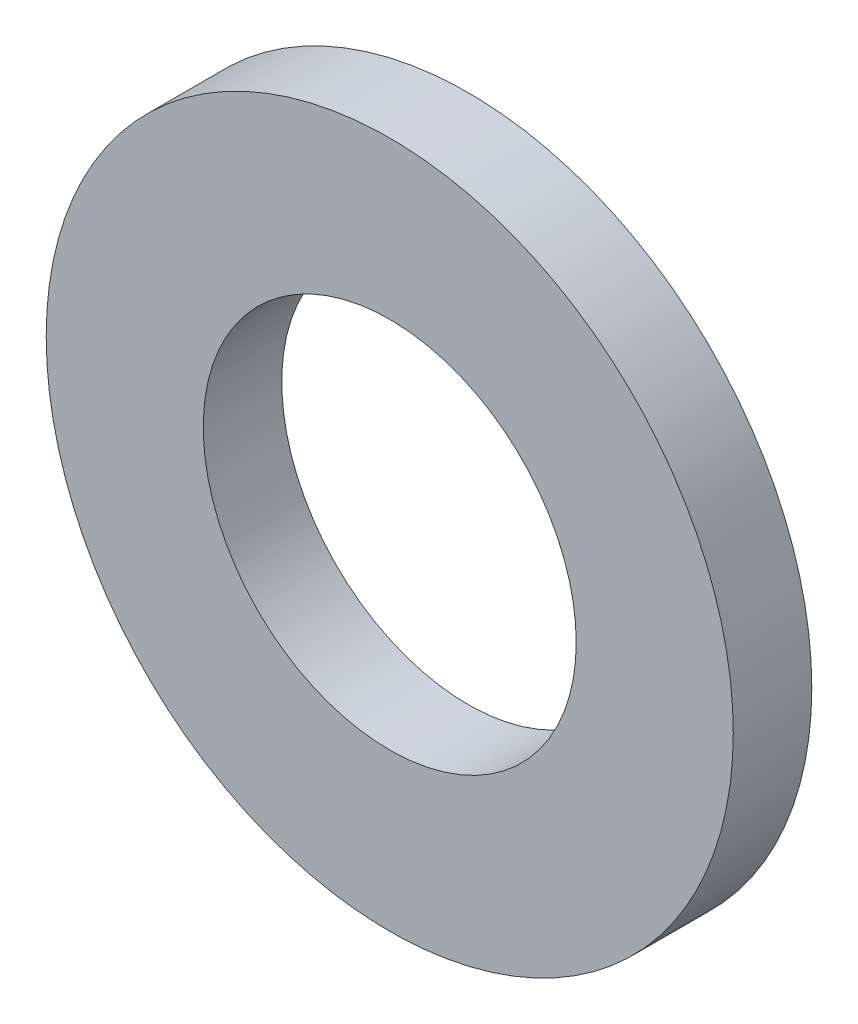
ISO-10303-21;
HEADER;
FILE_DESCRIPTION(('STEP AP214'),'2;1');
FILE_NAME('part.step','',(''),(''),'','','');
FILE_SCHEMA(('AUTOMOTIVE_DESIGN { 1 0 10303 214 1 1 1 1 }'));
ENDSEC;
DATA;
#1=APPLICATION_CONTEXT('core data for automotive mechanical design processes');
#2=APPLICATION_PROTOCOL_DEFINITION('international standard','automotive_design',2000,#1);
#3=PRODUCT_CONTEXT('',#1,'mechanical');
#4=PRODUCT('Part','Part','',(#3));
#5=PRODUCT_RELATED_PRODUCT_CATEGORY('part','',(#4));
#6=PRODUCT_DEFINITION_FORMATION('','',#4);
#7=PRODUCT_DEFINITION_CONTEXT('part definition',#1,'design');
#8=PRODUCT_DEFINITION('design','',#6,#7);
#9=PRODUCT_DEFINITION_SHAPE('','',#8);
#10=(LENGTH_UNIT() NAMED_UNIT(*) SI_UNIT(.MILLI.,.METRE.));
#11=(NAMED_UNIT(*) PLANE_ANGLE_UNIT() SI_UNIT($,.RADIAN.));
#12=(NAMED_UNIT(*) SI_UNIT($,.STERADIAN.) SOLID_ANGLE_UNIT());
#13=UNCERTAINTY_MEASURE_WITH_UNIT(LENGTH_MEASURE(1.E-05),#10,'distance_accuracy_value','');
#14=(GEOMETRIC_REPRESENTATION_CONTEXT(3) GLOBAL_UNCERTAINTY_ASSIGNED_CONTEXT((#13)) GLOBAL_UNIT_ASSIGNED_CONTEXT((#10,
#11,#12)) REPRESENTATION_CONTEXT('',''));
#15=CARTESIAN_POINT('',(0.,0.,0.));
#16=DIRECTION('',(0.,0.,1.));
#17=DIRECTION('',(1.,0.,0.));
#18=AXIS2_PLACEMENT_3D('',#15,#16,#17);
#19=CARTESIAN_POINT('',(0.,0.,0.8));
#20=DIRECTION('',(0.,0.,1.));
#21=DIRECTION('',(1.,0.,0.));
#22=AXIS2_PLACEMENT_3D('',#19,#20,#21);
#23=PLANE('',#22);
#24=CARTESIAN_POINT('',(0.,0.,0.8));
#25=DIRECTION('',(0.,0.,1.));
#26=DIRECTION('',(1.,0.,0.));
#27=AXIS2_PLACEMENT_3D('',#24,#25,#26);
#28=CIRCLE('',#27,3.5);
#29=CARTESIAN_POINT('',(3.5,0.,0.8));
#30=VERTEX_POINT('',#29);
#31=EDGE_CURVE('E10',#30,#30,#28,.T.);
#32=ORIENTED_EDGE('',*,*,#31,.T.);
#33=EDGE_LOOP('',(#32));
#34=FACE_BOUND('',#33,.T.);
#35=CARTESIAN_POINT('',(0.,0.,0.8));
#36=DIRECTION('',(0.,0.,1.));
#37=DIRECTION('',(1.,0.,0.));
#38=AXIS2_PLACEMENT_3D('',#35,#36,#37);
#39=CIRCLE('',#38,1.9);
#40=CARTESIAN_POINT('',(1.9,0.,0.8));
#41=VERTEX_POINT('',#40);
#42=EDGE_CURVE('E41',#41,#41,#39,.T.);
#43=ORIENTED_EDGE('',*,*,#42,.F.);
#44=EDGE_LOOP('',(#43));
#45=FACE_BOUND('',#44,.T.);
#46=ADVANCED_FACE('F30',(#34,#45),#23,.T.);
#47=CARTESIAN_POINT('',(0.,0.,0.));
#48=DIRECTION('',(0.,0.,1.));
#49=DIRECTION('',(1.,0.,0.));
#50=AXIS2_PLACEMENT_3D('',#47,#48,#49);
#51=PLANE('',#50);
#52=CARTESIAN_POINT('',(0.,0.,0.));
#53=DIRECTION('',(0.,0.,1.));
#54=DIRECTION('',(1.,0.,0.));
#55=AXIS2_PLACEMENT_3D('',#52,#53,#54);
#56=CIRCLE('',#55,3.5);
#57=CARTESIAN_POINT('',(3.5,0.,0.));
#58=VERTEX_POINT('',#57);
#59=EDGE_CURVE('E37',#58,#58,#56,.T.);
#60=ORIENTED_EDGE('',*,*,#59,.F.);
#61=EDGE_LOOP('',(#60));
#62=FACE_BOUND('',#61,.T.);
#63=CARTESIAN_POINT('',(0.,0.,0.));
#64=DIRECTION('',(0.,0.,1.));
#65=DIRECTION('',(1.,0.,0.));
#66=AXIS2_PLACEMENT_3D('',#63,#64,#65);
#67=CIRCLE('',#66,1.9);
#68=CARTESIAN_POINT('',(1.9,0.,0.));
#69=VERTEX_POINT('',#68);
#70=EDGE_CURVE('E45',#69,#69,#67,.T.);
#71=ORIENTED_EDGE('',*,*,#70,.T.);
#72=EDGE_LOOP('',(#71));
#73=FACE_BOUND('',#72,.T.);
#74=ADVANCED_FACE('F51',(#62,#73),#51,.F.);
#75=CARTESIAN_POINT('',(0.,0.,0.8));
#76=DIRECTION('',(0.,0.,-1.));
#77=DIRECTION('',(-1.,0.,0.));
#78=AXIS2_PLACEMENT_3D('',#75,#76,#77);
#79=CYLINDRICAL_SURFACE('',#78,3.5);
#80=ORIENTED_EDGE('',*,*,#31,.F.);
#81=EDGE_LOOP('',(#80));
#82=FACE_BOUND('',#81,.T.);
#83=ORIENTED_EDGE('',*,*,#59,.T.);
#84=EDGE_LOOP('',(#83));
#85=FACE_BOUND('',#84,.T.);
#86=ADVANCED_FACE('F32',(#82,#85),#79,.T.);
#87=CARTESIAN_POINT('',(0.,0.,0.8));
#88=DIRECTION('',(0.,0.,-1.));
#89=DIRECTION('',(-1.,0.,0.));
#90=AXIS2_PLACEMENT_3D('',#87,#88,#89);
#91=CYLINDRICAL_SURFACE('',#90,1.9);
#92=ORIENTED_EDGE('',*,*,#42,.T.);
#93=EDGE_LOOP('',(#92));
#94=FACE_BOUND('',#93,.T.);
#95=ORIENTED_EDGE('',*,*,#70,.F.);
#96=EDGE_LOOP('',(#95));
#97=FACE_BOUND('',#96,.T.);
#98=ADVANCED_FACE('F53',(#94,#97),#91,.F.);
#99=CLOSED_SHELL('',(#46,#74,#86,#98));
#100=MANIFOLD_SOLID_BREP('B2',#99);
#101=ADVANCED_BREP_SHAPE_REPRESENTATION('',(#18,#100),#14);
#102=SHAPE_DEFINITION_REPRESENTATION(#9,#101);
ENDSEC;
END-ISO-10303-21;
